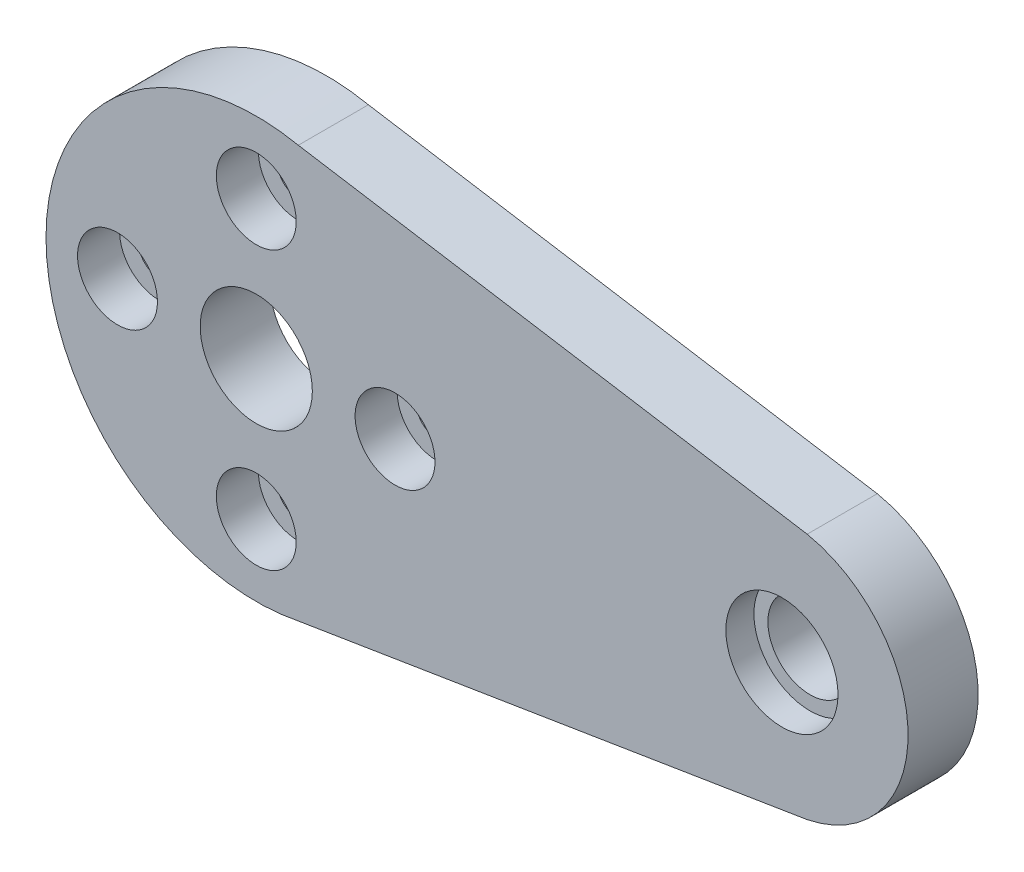
ISO-10303-21;
HEADER;
FILE_DESCRIPTION(('STEP AP214'),'2;1');
FILE_NAME('part.step','',(''),(''),'','','');
FILE_SCHEMA(('AUTOMOTIVE_DESIGN { 1 0 10303 214 1 1 1 1 }'));
ENDSEC;
DATA;
#1=APPLICATION_CONTEXT('core data for automotive mechanical design processes');
#2=APPLICATION_PROTOCOL_DEFINITION('international standard','automotive_design',2000,#1);
#3=PRODUCT_CONTEXT('',#1,'mechanical');
#4=PRODUCT('Part','Part','',(#3));
#5=PRODUCT_RELATED_PRODUCT_CATEGORY('part','',(#4));
#6=PRODUCT_DEFINITION_FORMATION('','',#4);
#7=PRODUCT_DEFINITION_CONTEXT('part definition',#1,'design');
#8=PRODUCT_DEFINITION('design','',#6,#7);
#9=PRODUCT_DEFINITION_SHAPE('','',#8);
#10=(LENGTH_UNIT() NAMED_UNIT(*) SI_UNIT(.MILLI.,.METRE.));
#11=(NAMED_UNIT(*) PLANE_ANGLE_UNIT() SI_UNIT($,.RADIAN.));
#12=(NAMED_UNIT(*) SI_UNIT($,.STERADIAN.) SOLID_ANGLE_UNIT());
#13=UNCERTAINTY_MEASURE_WITH_UNIT(LENGTH_MEASURE(1.E-05),#10,'distance_accuracy_value','');
#14=(GEOMETRIC_REPRESENTATION_CONTEXT(3) GLOBAL_UNCERTAINTY_ASSIGNED_CONTEXT((#13)) GLOBAL_UNIT_ASSIGNED_CONTEXT((#10,
#11,#12)) REPRESENTATION_CONTEXT('',''));
#15=CARTESIAN_POINT('',(0.,0.,0.));
#16=DIRECTION('',(0.,0.,1.));
#17=DIRECTION('',(1.,0.,0.));
#18=AXIS2_PLACEMENT_3D('',#15,#16,#17);
#19=CARTESIAN_POINT('',(-16.25,-10.0663502635741,-5.));
#20=DIRECTION('',(0.,0.,1.));
#21=DIRECTION('',(1.,0.,0.));
#22=AXIS2_PLACEMENT_3D('',#19,#20,#21);
#23=CYLINDRICAL_SURFACE('',#22,1.5);
#24=CARTESIAN_POINT('',(-16.25,-10.0663502635741,0.));
#25=DIRECTION('',(0.,0.,1.));
#26=DIRECTION('',(1.,0.,0.));
#27=AXIS2_PLACEMENT_3D('',#24,#25,#26);
#28=CIRCLE('',#27,1.5);
#29=CARTESIAN_POINT('',(-14.75,-10.0663502635741,0.));
#30=VERTEX_POINT('',#29);
#31=EDGE_CURVE('E130',#30,#30,#28,.T.);
#32=ORIENTED_EDGE('',*,*,#31,.F.);
#33=EDGE_LOOP('',(#32));
#34=FACE_BOUND('',#33,.T.);
#35=CARTESIAN_POINT('',(-16.25,-10.0663502635741,2.));
#36=DIRECTION('',(0.,0.,1.));
#37=DIRECTION('',(1.,0.,0.));
#38=AXIS2_PLACEMENT_3D('',#35,#36,#37);
#39=CIRCLE('',#38,1.5);
#40=CARTESIAN_POINT('',(-14.75,-10.0663502635741,2.));
#41=VERTEX_POINT('',#40);
#42=EDGE_CURVE('E40',#41,#41,#39,.F.);
#43=ORIENTED_EDGE('',*,*,#42,.F.);
#44=EDGE_LOOP('',(#43));
#45=FACE_BOUND('',#44,.T.);
#46=ADVANCED_FACE('F36',(#34,#45),#23,.F.);
#47=CARTESIAN_POINT('',(-26.15,-0.166350263574117,-5.));
#48=DIRECTION('',(0.,0.,1.));
#49=DIRECTION('',(1.,0.,0.));
#50=AXIS2_PLACEMENT_3D('',#47,#48,#49);
#51=CYLINDRICAL_SURFACE('',#50,1.5);
#52=CARTESIAN_POINT('',(-26.15,-0.166350263574117,0.));
#53=DIRECTION('',(0.,0.,1.));
#54=DIRECTION('',(1.,0.,0.));
#55=AXIS2_PLACEMENT_3D('',#52,#53,#54);
#56=CIRCLE('',#55,1.5);
#57=CARTESIAN_POINT('',(-24.65,-0.166350263574117,0.));
#58=VERTEX_POINT('',#57);
#59=EDGE_CURVE('E133',#58,#58,#56,.T.);
#60=ORIENTED_EDGE('',*,*,#59,.F.);
#61=EDGE_LOOP('',(#60));
#62=FACE_BOUND('',#61,.T.);
#63=CARTESIAN_POINT('',(-26.15,-0.166350263574117,2.));
#64=DIRECTION('',(0.,0.,1.));
#65=DIRECTION('',(1.,0.,0.));
#66=AXIS2_PLACEMENT_3D('',#63,#64,#65);
#67=CIRCLE('',#66,1.5);
#68=CARTESIAN_POINT('',(-24.65,-0.166350263574117,2.));
#69=VERTEX_POINT('',#68);
#70=EDGE_CURVE('E146',#69,#69,#67,.F.);
#71=ORIENTED_EDGE('',*,*,#70,.F.);
#72=EDGE_LOOP('',(#71));
#73=FACE_BOUND('',#72,.T.);
#74=ADVANCED_FACE('F218',(#62,#73),#51,.F.);
#75=CARTESIAN_POINT('',(-6.34999999999999,-0.166350263574117,-5.));
#76=DIRECTION('',(0.,0.,1.));
#77=DIRECTION('',(1.,0.,0.));
#78=AXIS2_PLACEMENT_3D('',#75,#76,#77);
#79=CYLINDRICAL_SURFACE('',#78,1.5);
#80=CARTESIAN_POINT('',(-6.34999999999999,-0.166350263574117,0.));
#81=DIRECTION('',(0.,0.,1.));
#82=DIRECTION('',(1.,0.,0.));
#83=AXIS2_PLACEMENT_3D('',#80,#81,#82);
#84=CIRCLE('',#83,1.5);
#85=CARTESIAN_POINT('',(-4.84999999999999,-0.166350263574117,0.));
#86=VERTEX_POINT('',#85);
#87=EDGE_CURVE('E129',#86,#86,#84,.T.);
#88=ORIENTED_EDGE('',*,*,#87,.F.);
#89=EDGE_LOOP('',(#88));
#90=FACE_BOUND('',#89,.T.);
#91=CARTESIAN_POINT('',(-6.34999999999999,-0.166350263574117,2.));
#92=DIRECTION('',(0.,0.,1.));
#93=DIRECTION('',(1.,0.,0.));
#94=AXIS2_PLACEMENT_3D('',#91,#92,#93);
#95=CIRCLE('',#94,1.5);
#96=CARTESIAN_POINT('',(-4.84999999999999,-0.166350263574117,2.));
#97=VERTEX_POINT('',#96);
#98=EDGE_CURVE('E144',#97,#97,#95,.F.);
#99=ORIENTED_EDGE('',*,*,#98,.F.);
#100=EDGE_LOOP('',(#99));
#101=FACE_BOUND('',#100,.T.);
#102=ADVANCED_FACE('F224',(#90,#101),#79,.F.);
#103=CARTESIAN_POINT('',(-16.25,9.73364973642588,-5.));
#104=DIRECTION('',(0.,0.,1.));
#105=DIRECTION('',(1.,0.,0.));
#106=AXIS2_PLACEMENT_3D('',#103,#104,#105);
#107=CYLINDRICAL_SURFACE('',#106,1.5);
#108=CARTESIAN_POINT('',(-16.25,9.73364973642588,0.));
#109=DIRECTION('',(0.,0.,1.));
#110=DIRECTION('',(1.,0.,0.));
#111=AXIS2_PLACEMENT_3D('',#108,#109,#110);
#112=CIRCLE('',#111,1.5);
#113=CARTESIAN_POINT('',(-14.75,9.73364973642588,0.));
#114=VERTEX_POINT('',#113);
#115=EDGE_CURVE('E124',#114,#114,#112,.T.);
#116=ORIENTED_EDGE('',*,*,#115,.F.);
#117=EDGE_LOOP('',(#116));
#118=FACE_BOUND('',#117,.T.);
#119=CARTESIAN_POINT('',(-16.25,9.73364973642588,2.));
#120=DIRECTION('',(0.,0.,1.));
#121=DIRECTION('',(1.,0.,0.));
#122=AXIS2_PLACEMENT_3D('',#119,#120,#121);
#123=CIRCLE('',#122,1.5);
#124=CARTESIAN_POINT('',(-14.75,9.73364973642588,2.));
#125=VERTEX_POINT('',#124);
#126=EDGE_CURVE('E134',#125,#125,#123,.F.);
#127=ORIENTED_EDGE('',*,*,#126,.F.);
#128=EDGE_LOOP('',(#127));
#129=FACE_BOUND('',#128,.T.);
#130=ADVANCED_FACE('F213',(#118,#129),#107,.F.);
#131=CARTESIAN_POINT('',(21.25,-0.166350263574117,5.));
#132=DIRECTION('',(0.,0.,-1.));
#133=DIRECTION('',(-1.,0.,0.));
#134=AXIS2_PLACEMENT_3D('',#131,#132,#133);
#135=CYLINDRICAL_SURFACE('',#134,4.00000000000001);
#136=CARTESIAN_POINT('',(21.25,-0.166350263574117,5.));
#137=DIRECTION('',(0.,0.,1.));
#138=DIRECTION('',(1.,0.,0.));
#139=AXIS2_PLACEMENT_3D('',#136,#137,#138);
#140=CIRCLE('',#139,4.00000000000001);
#141=CARTESIAN_POINT('',(25.25,-0.166350263574117,5.));
#142=VERTEX_POINT('',#141);
#143=EDGE_CURVE('E114',#142,#142,#140,.T.);
#144=ORIENTED_EDGE('',*,*,#143,.T.);
#145=EDGE_LOOP('',(#144));
#146=FACE_BOUND('',#145,.T.);
#147=CARTESIAN_POINT('',(21.25,-0.166350263574117,3.));
#148=DIRECTION('',(0.,0.,-1.));
#149=DIRECTION('',(-1.,0.,0.));
#150=AXIS2_PLACEMENT_3D('',#147,#148,#149);
#151=CIRCLE('',#150,4.00000000000001);
#152=CARTESIAN_POINT('',(17.25,-0.166350263574117,3.));
#153=VERTEX_POINT('',#152);
#154=EDGE_CURVE('E175',#153,#153,#151,.T.);
#155=ORIENTED_EDGE('',*,*,#154,.T.);
#156=EDGE_LOOP('',(#155));
#157=FACE_BOUND('',#156,.T.);
#158=ADVANCED_FACE('F200',(#146,#157),#135,.F.);
#159=CARTESIAN_POINT('',(21.25,-0.166350263574117,5.));
#160=DIRECTION('',(0.,0.,1.));
#161=DIRECTION('',(1.,0.,0.));
#162=AXIS2_PLACEMENT_3D('',#159,#160,#161);
#163=PLANE('',#162);
#164=CARTESIAN_POINT('',(-26.15,-0.166350263574117,5.));
#165=DIRECTION('',(0.,0.,1.));
#166=DIRECTION('',(1.,0.,0.));
#167=AXIS2_PLACEMENT_3D('',#164,#165,#166);
#168=CIRCLE('',#167,2.85);
#169=CARTESIAN_POINT('',(-23.3,-0.166350263574117,5.));
#170=VERTEX_POINT('',#169);
#171=EDGE_CURVE('E444',#170,#170,#168,.T.);
#172=ORIENTED_EDGE('',*,*,#171,.F.);
#173=EDGE_LOOP('',(#172));
#174=FACE_BOUND('',#173,.T.);
#175=CARTESIAN_POINT('',(-6.34999999999999,-0.166350263574117,5.));
#176=DIRECTION('',(0.,0.,1.));
#177=DIRECTION('',(1.,0.,0.));
#178=AXIS2_PLACEMENT_3D('',#175,#176,#177);
#179=CIRCLE('',#178,2.85);
#180=CARTESIAN_POINT('',(-3.49999999999999,-0.166350263574117,5.));
#181=VERTEX_POINT('',#180);
#182=EDGE_CURVE('E453',#181,#181,#179,.T.);
#183=ORIENTED_EDGE('',*,*,#182,.F.);
#184=EDGE_LOOP('',(#183));
#185=FACE_BOUND('',#184,.T.);
#186=CARTESIAN_POINT('',(-16.25,-10.0663502635741,5.));
#187=DIRECTION('',(0.,0.,1.));
#188=DIRECTION('',(1.,0.,0.));
#189=AXIS2_PLACEMENT_3D('',#186,#187,#188);
#190=CIRCLE('',#189,2.85);
#191=CARTESIAN_POINT('',(-13.4,-10.0663502635741,5.));
#192=VERTEX_POINT('',#191);
#193=EDGE_CURVE('E458',#192,#192,#190,.T.);
#194=ORIENTED_EDGE('',*,*,#193,.F.);
#195=EDGE_LOOP('',(#194));
#196=FACE_BOUND('',#195,.T.);
#197=CARTESIAN_POINT('',(-16.25,9.73364973642588,5.));
#198=DIRECTION('',(0.,0.,1.));
#199=DIRECTION('',(1.,0.,0.));
#200=AXIS2_PLACEMENT_3D('',#197,#198,#199);
#201=CIRCLE('',#200,2.85);
#202=CARTESIAN_POINT('',(-13.4,9.73364973642588,5.));
#203=VERTEX_POINT('',#202);
#204=EDGE_CURVE('E157',#203,#203,#201,.T.);
#205=ORIENTED_EDGE('',*,*,#204,.F.);
#206=EDGE_LOOP('',(#205));
#207=FACE_BOUND('',#206,.T.);
#208=ORIENTED_EDGE('',*,*,#143,.F.);
#209=EDGE_LOOP('',(#208));
#210=FACE_BOUND('',#209,.T.);
#211=CARTESIAN_POINT('',(21.25,-0.166350263574117,5.));
#212=DIRECTION('',(0.,0.,1.));
#213=DIRECTION('',(1.,0.,0.));
#214=AXIS2_PLACEMENT_3D('',#211,#212,#213);
#215=CIRCLE('',#214,8.99999999999999);
#216=CARTESIAN_POINT('',(23.05,-8.98451333759355,5.));
#217=VERTEX_POINT('',#216);
#218=CARTESIAN_POINT('',(23.05,8.65181281044532,5.));
#219=VERTEX_POINT('',#218);
#220=EDGE_CURVE('E92',#217,#219,#215,.T.);
#221=ORIENTED_EDGE('',*,*,#220,.T.);
#222=DIRECTION('',(-0.987138589902085,0.159866833102189,0.));
#223=VECTOR('',#222,1.);
#224=CARTESIAN_POINT('',(23.05,8.65181281044532,5.));
#225=LINE('',#224,#223);
#226=CARTESIAN_POINT('',(-13.25,14.5305881931249,5.));
#227=VERTEX_POINT('',#226);
#228=EDGE_CURVE('E86',#219,#227,#225,.T.);
#229=ORIENTED_EDGE('',*,*,#228,.T.);
#230=CARTESIAN_POINT('',(-16.25,-0.166350263574117,5.));
#231=DIRECTION('',(0.,0.,1.));
#232=DIRECTION('',(1.,0.,0.));
#233=AXIS2_PLACEMENT_3D('',#230,#231,#232);
#234=CIRCLE('',#233,15.);
#235=CARTESIAN_POINT('',(-13.25,-14.8632887202732,5.));
#236=VERTEX_POINT('',#235);
#237=EDGE_CURVE('E90',#227,#236,#234,.T.);
#238=ORIENTED_EDGE('',*,*,#237,.T.);
#239=DIRECTION('',(0.987138589902085,0.159866833102189,0.));
#240=VECTOR('',#239,1.);
#241=CARTESIAN_POINT('',(-13.25,-14.8632887202732,5.));
#242=LINE('',#241,#240);
#243=EDGE_CURVE('E56',#236,#217,#242,.T.);
#244=ORIENTED_EDGE('',*,*,#243,.T.);
#245=EDGE_LOOP('',(#221,#229,#238,#244));
#246=FACE_BOUND('',#245,.T.);
#247=CARTESIAN_POINT('',(-16.25,-0.166350263574117,5.));
#248=DIRECTION('',(0.,0.,1.));
#249=DIRECTION('',(1.,0.,0.));
#250=AXIS2_PLACEMENT_3D('',#247,#248,#249);
#251=CIRCLE('',#250,4.);
#252=CARTESIAN_POINT('',(-12.25,-0.166350263574117,5.));
#253=VERTEX_POINT('',#252);
#254=EDGE_CURVE('E183',#253,#253,#251,.T.);
#255=ORIENTED_EDGE('',*,*,#254,.F.);
#256=EDGE_LOOP('',(#255));
#257=FACE_BOUND('',#256,.T.);
#258=ADVANCED_FACE('F87',(#174,#185,#196,#207,#210,#246,#257),#163,.T.);
#259=CARTESIAN_POINT('',(21.25,-0.166350263574117,0.));
#260=DIRECTION('',(0.,0.,1.));
#261=DIRECTION('',(1.,0.,0.));
#262=AXIS2_PLACEMENT_3D('',#259,#260,#261);
#263=PLANE('',#262);
#264=ORIENTED_EDGE('',*,*,#87,.T.);
#265=EDGE_LOOP('',(#264));
#266=FACE_BOUND('',#265,.T.);
#267=ORIENTED_EDGE('',*,*,#59,.T.);
#268=EDGE_LOOP('',(#267));
#269=FACE_BOUND('',#268,.T.);
#270=ORIENTED_EDGE('',*,*,#31,.T.);
#271=EDGE_LOOP('',(#270));
#272=FACE_BOUND('',#271,.T.);
#273=ORIENTED_EDGE('',*,*,#115,.T.);
#274=EDGE_LOOP('',(#273));
#275=FACE_BOUND('',#274,.T.);
#276=CARTESIAN_POINT('',(21.25,-0.166350263574117,0.));
#277=DIRECTION('',(0.,0.,1.));
#278=DIRECTION('',(1.,0.,0.));
#279=AXIS2_PLACEMENT_3D('',#276,#277,#278);
#280=CIRCLE('',#279,8.99999999999999);
#281=CARTESIAN_POINT('',(23.05,-8.98451333759355,0.));
#282=VERTEX_POINT('',#281);
#283=CARTESIAN_POINT('',(23.05,8.65181281044532,0.));
#284=VERTEX_POINT('',#283);
#285=EDGE_CURVE('E110',#282,#284,#280,.T.);
#286=ORIENTED_EDGE('',*,*,#285,.F.);
#287=DIRECTION('',(0.987138589902085,0.159866833102189,0.));
#288=VECTOR('',#287,1.);
#289=CARTESIAN_POINT('',(-13.25,-14.8632887202732,0.));
#290=LINE('',#289,#288);
#291=CARTESIAN_POINT('',(-13.25,-14.8632887202732,0.));
#292=VERTEX_POINT('',#291);
#293=EDGE_CURVE('E79',#292,#282,#290,.T.);
#294=ORIENTED_EDGE('',*,*,#293,.F.);
#295=CARTESIAN_POINT('',(-16.25,-0.166350263574117,0.));
#296=DIRECTION('',(0.,0.,1.));
#297=DIRECTION('',(1.,0.,0.));
#298=AXIS2_PLACEMENT_3D('',#295,#296,#297);
#299=CIRCLE('',#298,15.);
#300=CARTESIAN_POINT('',(-13.25,14.5305881931249,0.));
#301=VERTEX_POINT('',#300);
#302=EDGE_CURVE('E73',#301,#292,#299,.T.);
#303=ORIENTED_EDGE('',*,*,#302,.F.);
#304=DIRECTION('',(-0.987138589902085,0.159866833102189,0.));
#305=VECTOR('',#304,1.);
#306=CARTESIAN_POINT('',(23.05,8.65181281044532,0.));
#307=LINE('',#306,#305);
#308=EDGE_CURVE('E96',#284,#301,#307,.T.);
#309=ORIENTED_EDGE('',*,*,#308,.F.);
#310=EDGE_LOOP('',(#286,#294,#303,#309));
#311=FACE_BOUND('',#310,.T.);
#312=CARTESIAN_POINT('',(-16.25,-0.166350263574117,0.));
#313=DIRECTION('',(0.,0.,1.));
#314=DIRECTION('',(1.,0.,0.));
#315=AXIS2_PLACEMENT_3D('',#312,#313,#314);
#316=CIRCLE('',#315,4.);
#317=CARTESIAN_POINT('',(-12.25,-0.166350263574117,0.));
#318=VERTEX_POINT('',#317);
#319=EDGE_CURVE('E182',#318,#318,#316,.T.);
#320=ORIENTED_EDGE('',*,*,#319,.T.);
#321=EDGE_LOOP('',(#320));
#322=FACE_BOUND('',#321,.T.);
#323=CARTESIAN_POINT('',(21.25,-0.166350263574117,0.));
#324=DIRECTION('',(0.,0.,-1.));
#325=DIRECTION('',(-1.,0.,0.));
#326=AXIS2_PLACEMENT_3D('',#323,#324,#325);
#327=CIRCLE('',#326,3.);
#328=CARTESIAN_POINT('',(18.25,-0.166350263574117,0.));
#329=VERTEX_POINT('',#328);
#330=EDGE_CURVE('E128',#329,#329,#327,.T.);
#331=ORIENTED_EDGE('',*,*,#330,.F.);
#332=EDGE_LOOP('',(#331));
#333=FACE_BOUND('',#332,.T.);
#334=ADVANCED_FACE('F204',(#266,#269,#272,#275,#311,#322,#333),#263,.F.);
#335=CARTESIAN_POINT('',(21.25,-0.166350263574117,5.));
#336=DIRECTION('',(0.,0.,-1.));
#337=DIRECTION('',(-1.,0.,0.));
#338=AXIS2_PLACEMENT_3D('',#335,#336,#337);
#339=CYLINDRICAL_SURFACE('',#338,8.99999999999999);
#340=ORIENTED_EDGE('',*,*,#285,.T.);
#341=DIRECTION('',(0.,0.,-1.));
#342=VECTOR('',#341,1.);
#343=CARTESIAN_POINT('',(23.05,8.65181281044532,5.));
#344=LINE('',#343,#342);
#345=EDGE_CURVE('E11',#219,#284,#344,.T.);
#346=ORIENTED_EDGE('',*,*,#345,.F.);
#347=ORIENTED_EDGE('',*,*,#220,.F.);
#348=DIRECTION('',(0.,0.,-1.));
#349=VECTOR('',#348,1.);
#350=CARTESIAN_POINT('',(23.05,-8.98451333759355,5.));
#351=LINE('',#350,#349);
#352=EDGE_CURVE('E106',#217,#282,#351,.T.);
#353=ORIENTED_EDGE('',*,*,#352,.T.);
#354=EDGE_LOOP('',(#340,#346,#347,#353));
#355=FACE_BOUND('',#354,.T.);
#356=ADVANCED_FACE('F38',(#355),#339,.T.);
#357=CARTESIAN_POINT('',(23.05,8.65181281044532,5.));
#358=DIRECTION('',(-0.159866833102189,-0.987138589902085,0.));
#359=DIRECTION('',(0.987138589902085,-0.159866833102189,0.));
#360=AXIS2_PLACEMENT_3D('',#357,#358,#359);
#361=PLANE('',#360);
#362=ORIENTED_EDGE('',*,*,#308,.T.);
#363=DIRECTION('',(0.,0.,-1.));
#364=VECTOR('',#363,1.);
#365=CARTESIAN_POINT('',(-13.25,14.5305881931249,5.));
#366=LINE('',#365,#364);
#367=EDGE_CURVE('E47',#227,#301,#366,.T.);
#368=ORIENTED_EDGE('',*,*,#367,.F.);
#369=ORIENTED_EDGE('',*,*,#228,.F.);
#370=ORIENTED_EDGE('',*,*,#345,.T.);
#371=EDGE_LOOP('',(#362,#368,#369,#370));
#372=FACE_BOUND('',#371,.T.);
#373=ADVANCED_FACE('F95',(#372),#361,.F.);
#374=CARTESIAN_POINT('',(-16.25,-0.166350263574117,5.));
#375=DIRECTION('',(0.,0.,-1.));
#376=DIRECTION('',(-1.,0.,0.));
#377=AXIS2_PLACEMENT_3D('',#374,#375,#376);
#378=CYLINDRICAL_SURFACE('',#377,15.);
#379=ORIENTED_EDGE('',*,*,#302,.T.);
#380=DIRECTION('',(0.,0.,-1.));
#381=VECTOR('',#380,1.);
#382=CARTESIAN_POINT('',(-13.25,-14.8632887202732,5.));
#383=LINE('',#382,#381);
#384=EDGE_CURVE('E97',#236,#292,#383,.T.);
#385=ORIENTED_EDGE('',*,*,#384,.F.);
#386=ORIENTED_EDGE('',*,*,#237,.F.);
#387=ORIENTED_EDGE('',*,*,#367,.T.);
#388=EDGE_LOOP('',(#379,#385,#386,#387));
#389=FACE_BOUND('',#388,.T.);
#390=ADVANCED_FACE('F99',(#389),#378,.T.);
#391=CARTESIAN_POINT('',(-13.25,-14.8632887202732,5.));
#392=DIRECTION('',(-0.159866833102189,0.987138589902085,0.));
#393=DIRECTION('',(-0.987138589902085,-0.159866833102189,0.));
#394=AXIS2_PLACEMENT_3D('',#391,#392,#393);
#395=PLANE('',#394);
#396=ORIENTED_EDGE('',*,*,#293,.T.);
#397=ORIENTED_EDGE('',*,*,#352,.F.);
#398=ORIENTED_EDGE('',*,*,#243,.F.);
#399=ORIENTED_EDGE('',*,*,#384,.T.);
#400=EDGE_LOOP('',(#396,#397,#398,#399));
#401=FACE_BOUND('',#400,.T.);
#402=ADVANCED_FACE('F245',(#401),#395,.F.);
#403=CARTESIAN_POINT('',(-16.25,-0.166350263574117,5.));
#404=DIRECTION('',(0.,0.,-1.));
#405=DIRECTION('',(-1.,0.,0.));
#406=AXIS2_PLACEMENT_3D('',#403,#404,#405);
#407=CYLINDRICAL_SURFACE('',#406,4.);
#408=ORIENTED_EDGE('',*,*,#254,.T.);
#409=EDGE_LOOP('',(#408));
#410=FACE_BOUND('',#409,.T.);
#411=ORIENTED_EDGE('',*,*,#319,.F.);
#412=EDGE_LOOP('',(#411));
#413=FACE_BOUND('',#412,.T.);
#414=ADVANCED_FACE('F242',(#410,#413),#407,.F.);
#415=CARTESIAN_POINT('',(21.25,-0.166350263574117,3.));
#416=DIRECTION('',(0.,0.,-1.));
#417=DIRECTION('',(-1.,0.,0.));
#418=AXIS2_PLACEMENT_3D('',#415,#416,#417);
#419=PLANE('',#418);
#420=CARTESIAN_POINT('',(21.25,-0.166350263574117,3.));
#421=DIRECTION('',(0.,0.,-1.));
#422=DIRECTION('',(-1.,0.,0.));
#423=AXIS2_PLACEMENT_3D('',#420,#421,#422);
#424=CIRCLE('',#423,3.);
#425=CARTESIAN_POINT('',(18.25,-0.166350263574117,3.));
#426=VERTEX_POINT('',#425);
#427=EDGE_CURVE('E171',#426,#426,#424,.T.);
#428=ORIENTED_EDGE('',*,*,#427,.T.);
#429=EDGE_LOOP('',(#428));
#430=FACE_BOUND('',#429,.T.);
#431=ORIENTED_EDGE('',*,*,#154,.F.);
#432=EDGE_LOOP('',(#431));
#433=FACE_BOUND('',#432,.T.);
#434=ADVANCED_FACE('F238',(#430,#433),#419,.F.);
#435=CARTESIAN_POINT('',(21.25,-0.166350263574117,3.));
#436=DIRECTION('',(0.,0.,-1.));
#437=DIRECTION('',(-1.,0.,0.));
#438=AXIS2_PLACEMENT_3D('',#435,#436,#437);
#439=CYLINDRICAL_SURFACE('',#438,3.);
#440=ORIENTED_EDGE('',*,*,#427,.F.);
#441=EDGE_LOOP('',(#440));
#442=FACE_BOUND('',#441,.T.);
#443=ORIENTED_EDGE('',*,*,#330,.T.);
#444=EDGE_LOOP('',(#443));
#445=FACE_BOUND('',#444,.T.);
#446=ADVANCED_FACE('F234',(#442,#445),#439,.F.);
#447=CARTESIAN_POINT('',(-16.25,9.73364973642588,2.));
#448=DIRECTION('',(0.,0.,1.));
#449=DIRECTION('',(1.,0.,0.));
#450=AXIS2_PLACEMENT_3D('',#447,#448,#449);
#451=PLANE('',#450);
#452=CARTESIAN_POINT('',(-16.25,9.73364973642588,2.));
#453=DIRECTION('',(0.,0.,1.));
#454=DIRECTION('',(1.,0.,0.));
#455=AXIS2_PLACEMENT_3D('',#452,#453,#454);
#456=CIRCLE('',#455,2.85);
#457=CARTESIAN_POINT('',(-13.4,9.73364973642588,2.));
#458=VERTEX_POINT('',#457);
#459=EDGE_CURVE('E143',#458,#458,#456,.T.);
#460=ORIENTED_EDGE('',*,*,#459,.T.);
#461=EDGE_LOOP('',(#460));
#462=FACE_BOUND('',#461,.T.);
#463=ORIENTED_EDGE('',*,*,#126,.T.);
#464=EDGE_LOOP('',(#463));
#465=FACE_BOUND('',#464,.T.);
#466=ADVANCED_FACE('F237',(#462,#465),#451,.T.);
#467=CARTESIAN_POINT('',(-16.25,9.73364973642588,2.));
#468=DIRECTION('',(0.,0.,1.));
#469=DIRECTION('',(1.,0.,0.));
#470=AXIS2_PLACEMENT_3D('',#467,#468,#469);
#471=CYLINDRICAL_SURFACE('',#470,2.85);
#472=ORIENTED_EDGE('',*,*,#459,.F.);
#473=EDGE_LOOP('',(#472));
#474=FACE_BOUND('',#473,.T.);
#475=ORIENTED_EDGE('',*,*,#204,.T.);
#476=EDGE_LOOP('',(#475));
#477=FACE_BOUND('',#476,.T.);
#478=ADVANCED_FACE('F310',(#474,#477),#471,.F.);
#479=CARTESIAN_POINT('',(-6.34999999999999,-0.166350263574117,2.));
#480=DIRECTION('',(0.,0.,1.));
#481=DIRECTION('',(1.,0.,0.));
#482=AXIS2_PLACEMENT_3D('',#479,#480,#481);
#483=PLANE('',#482);
#484=CARTESIAN_POINT('',(-6.34999999999999,-0.166350263574117,2.));
#485=DIRECTION('',(0.,0.,1.));
#486=DIRECTION('',(1.,0.,0.));
#487=AXIS2_PLACEMENT_3D('',#484,#485,#486);
#488=CIRCLE('',#487,2.85);
#489=CARTESIAN_POINT('',(-3.49999999999999,-0.166350263574117,2.));
#490=VERTEX_POINT('',#489);
#491=EDGE_CURVE('E448',#490,#490,#488,.T.);
#492=ORIENTED_EDGE('',*,*,#491,.T.);
#493=EDGE_LOOP('',(#492));
#494=FACE_BOUND('',#493,.T.);
#495=ORIENTED_EDGE('',*,*,#98,.T.);
#496=EDGE_LOOP('',(#495));
#497=FACE_BOUND('',#496,.T.);
#498=ADVANCED_FACE('F319',(#494,#497),#483,.T.);
#499=CARTESIAN_POINT('',(-6.34999999999999,-0.166350263574117,2.));
#500=DIRECTION('',(0.,0.,1.));
#501=DIRECTION('',(1.,0.,0.));
#502=AXIS2_PLACEMENT_3D('',#499,#500,#501);
#503=CYLINDRICAL_SURFACE('',#502,2.85);
#504=ORIENTED_EDGE('',*,*,#491,.F.);
#505=EDGE_LOOP('',(#504));
#506=FACE_BOUND('',#505,.T.);
#507=ORIENTED_EDGE('',*,*,#182,.T.);
#508=EDGE_LOOP('',(#507));
#509=FACE_BOUND('',#508,.T.);
#510=ADVANCED_FACE('F327',(#506,#509),#503,.F.);
#511=CARTESIAN_POINT('',(-26.15,-0.166350263574117,2.));
#512=DIRECTION('',(0.,0.,1.));
#513=DIRECTION('',(1.,0.,0.));
#514=AXIS2_PLACEMENT_3D('',#511,#512,#513);
#515=PLANE('',#514);
#516=CARTESIAN_POINT('',(-26.15,-0.166350263574117,2.));
#517=DIRECTION('',(0.,0.,1.));
#518=DIRECTION('',(1.,0.,0.));
#519=AXIS2_PLACEMENT_3D('',#516,#517,#518);
#520=CIRCLE('',#519,2.85);
#521=CARTESIAN_POINT('',(-23.3,-0.166350263574117,2.));
#522=VERTEX_POINT('',#521);
#523=EDGE_CURVE('E147',#522,#522,#520,.T.);
#524=ORIENTED_EDGE('',*,*,#523,.T.);
#525=EDGE_LOOP('',(#524));
#526=FACE_BOUND('',#525,.T.);
#527=ORIENTED_EDGE('',*,*,#70,.T.);
#528=EDGE_LOOP('',(#527));
#529=FACE_BOUND('',#528,.T.);
#530=ADVANCED_FACE('F334',(#526,#529),#515,.T.);
#531=CARTESIAN_POINT('',(-26.15,-0.166350263574117,2.));
#532=DIRECTION('',(0.,0.,1.));
#533=DIRECTION('',(1.,0.,0.));
#534=AXIS2_PLACEMENT_3D('',#531,#532,#533);
#535=CYLINDRICAL_SURFACE('',#534,2.85);
#536=ORIENTED_EDGE('',*,*,#523,.F.);
#537=EDGE_LOOP('',(#536));
#538=FACE_BOUND('',#537,.T.);
#539=ORIENTED_EDGE('',*,*,#171,.T.);
#540=EDGE_LOOP('',(#539));
#541=FACE_BOUND('',#540,.T.);
#542=ADVANCED_FACE('F342',(#538,#541),#535,.F.);
#543=CARTESIAN_POINT('',(-16.25,-10.0663502635741,2.));
#544=DIRECTION('',(0.,0.,1.));
#545=DIRECTION('',(1.,0.,0.));
#546=AXIS2_PLACEMENT_3D('',#543,#544,#545);
#547=PLANE('',#546);
#548=CARTESIAN_POINT('',(-16.25,-10.0663502635741,2.));
#549=DIRECTION('',(0.,0.,1.));
#550=DIRECTION('',(1.,0.,0.));
#551=AXIS2_PLACEMENT_3D('',#548,#549,#550);
#552=CIRCLE('',#551,2.85);
#553=CARTESIAN_POINT('',(-13.4,-10.0663502635741,2.));
#554=VERTEX_POINT('',#553);
#555=EDGE_CURVE('E456',#554,#554,#552,.T.);
#556=ORIENTED_EDGE('',*,*,#555,.T.);
#557=EDGE_LOOP('',(#556));
#558=FACE_BOUND('',#557,.T.);
#559=ORIENTED_EDGE('',*,*,#42,.T.);
#560=EDGE_LOOP('',(#559));
#561=FACE_BOUND('',#560,.T.);
#562=ADVANCED_FACE('F350',(#558,#561),#547,.T.);
#563=CARTESIAN_POINT('',(-16.25,-10.0663502635741,2.));
#564=DIRECTION('',(0.,0.,1.));
#565=DIRECTION('',(1.,0.,0.));
#566=AXIS2_PLACEMENT_3D('',#563,#564,#565);
#567=CYLINDRICAL_SURFACE('',#566,2.85);
#568=ORIENTED_EDGE('',*,*,#555,.F.);
#569=EDGE_LOOP('',(#568));
#570=FACE_BOUND('',#569,.T.);
#571=ORIENTED_EDGE('',*,*,#193,.T.);
#572=EDGE_LOOP('',(#571));
#573=FACE_BOUND('',#572,.T.);
#574=ADVANCED_FACE('F359',(#570,#573),#567,.F.);
#575=CLOSED_SHELL('',(#46,#74,#102,#130,#158,#258,#334,#356,#373,#390,#402,#414,#434,#446,#466,
#478,#498,#510,#530,#542,#562,#574));
#576=MANIFOLD_SOLID_BREP('B2',#575);
#577=ADVANCED_BREP_SHAPE_REPRESENTATION('',(#18,#576),#14);
#578=SHAPE_DEFINITION_REPRESENTATION(#9,#577);
ENDSEC;
END-ISO-10303-21;
